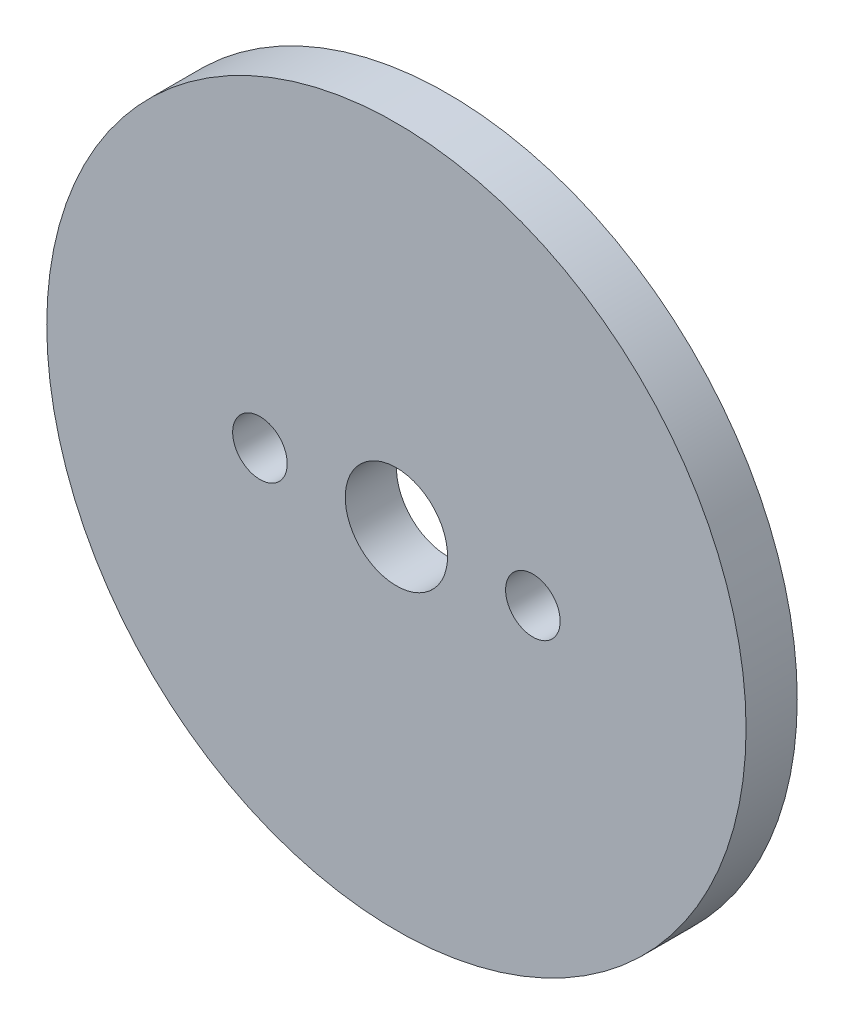
ISO-10303-21;
HEADER;
FILE_DESCRIPTION(('STEP AP214'),'2;1');
FILE_NAME('part.step','',(''),(''),'','','');
FILE_SCHEMA(('AUTOMOTIVE_DESIGN { 1 0 10303 214 1 1 1 1 }'));
ENDSEC;
DATA;
#1=APPLICATION_CONTEXT('core data for automotive mechanical design processes');
#2=APPLICATION_PROTOCOL_DEFINITION('international standard','automotive_design',2000,#1);
#3=PRODUCT_CONTEXT('',#1,'mechanical');
#4=PRODUCT('Part','Part','',(#3));
#5=PRODUCT_RELATED_PRODUCT_CATEGORY('part','',(#4));
#6=PRODUCT_DEFINITION_FORMATION('','',#4);
#7=PRODUCT_DEFINITION_CONTEXT('part definition',#1,'design');
#8=PRODUCT_DEFINITION('design','',#6,#7);
#9=PRODUCT_DEFINITION_SHAPE('','',#8);
#10=(LENGTH_UNIT() NAMED_UNIT(*) SI_UNIT(.MILLI.,.METRE.));
#11=(NAMED_UNIT(*) PLANE_ANGLE_UNIT() SI_UNIT($,.RADIAN.));
#12=(NAMED_UNIT(*) SI_UNIT($,.STERADIAN.) SOLID_ANGLE_UNIT());
#13=UNCERTAINTY_MEASURE_WITH_UNIT(LENGTH_MEASURE(1.E-05),#10,'distance_accuracy_value','');
#14=(GEOMETRIC_REPRESENTATION_CONTEXT(3) GLOBAL_UNCERTAINTY_ASSIGNED_CONTEXT((#13)) GLOBAL_UNIT_ASSIGNED_CONTEXT((#10,
#11,#12)) REPRESENTATION_CONTEXT('',''));
#15=CARTESIAN_POINT('',(0.,0.,0.));
#16=DIRECTION('',(0.,0.,1.));
#17=DIRECTION('',(1.,0.,0.));
#18=AXIS2_PLACEMENT_3D('',#15,#16,#17);
#19=CARTESIAN_POINT('',(0.,0.,1.5));
#20=DIRECTION('',(0.,0.,1.));
#21=DIRECTION('',(1.,0.,0.));
#22=AXIS2_PLACEMENT_3D('',#19,#20,#21);
#23=PLANE('',#22);
#24=CARTESIAN_POINT('',(-8.,0.,1.5));
#25=DIRECTION('',(0.,0.,1.));
#26=DIRECTION('',(1.,0.,0.));
#27=AXIS2_PLACEMENT_3D('',#24,#25,#26);
#28=CIRCLE('',#27,1.6);
#29=CARTESIAN_POINT('',(-6.4,0.,1.5));
#30=VERTEX_POINT('',#29);
#31=EDGE_CURVE('E61',#30,#30,#28,.T.);
#32=ORIENTED_EDGE('',*,*,#31,.F.);
#33=EDGE_LOOP('',(#32));
#34=FACE_BOUND('',#33,.T.);
#35=CARTESIAN_POINT('',(0.,0.,1.5));
#36=DIRECTION('',(0.,0.,1.));
#37=DIRECTION('',(1.,0.,0.));
#38=AXIS2_PLACEMENT_3D('',#35,#36,#37);
#39=CIRCLE('',#38,20.5);
#40=CARTESIAN_POINT('',(20.5,0.,1.5));
#41=VERTEX_POINT('',#40);
#42=EDGE_CURVE('E11',#41,#41,#39,.T.);
#43=ORIENTED_EDGE('',*,*,#42,.T.);
#44=EDGE_LOOP('',(#43));
#45=FACE_BOUND('',#44,.T.);
#46=CARTESIAN_POINT('',(0.,0.,1.5));
#47=DIRECTION('',(0.,0.,1.));
#48=DIRECTION('',(1.,0.,0.));
#49=AXIS2_PLACEMENT_3D('',#46,#47,#48);
#50=CIRCLE('',#49,3.);
#51=CARTESIAN_POINT('',(3.,0.,1.5));
#52=VERTEX_POINT('',#51);
#53=EDGE_CURVE('E48',#52,#52,#50,.T.);
#54=ORIENTED_EDGE('',*,*,#53,.F.);
#55=EDGE_LOOP('',(#54));
#56=FACE_BOUND('',#55,.T.);
#57=CARTESIAN_POINT('',(8.,0.,1.5));
#58=DIRECTION('',(0.,0.,1.));
#59=DIRECTION('',(1.,0.,0.));
#60=AXIS2_PLACEMENT_3D('',#57,#58,#59);
#61=CIRCLE('',#60,1.6);
#62=CARTESIAN_POINT('',(9.6,0.,1.5));
#63=VERTEX_POINT('',#62);
#64=EDGE_CURVE('E62',#63,#63,#61,.T.);
#65=ORIENTED_EDGE('',*,*,#64,.F.);
#66=EDGE_LOOP('',(#65));
#67=FACE_BOUND('',#66,.T.);
#68=ADVANCED_FACE('F34',(#34,#45,#56,#67),#23,.T.);
#69=CARTESIAN_POINT('',(0.,0.,-1.5));
#70=DIRECTION('',(0.,0.,1.));
#71=DIRECTION('',(1.,0.,0.));
#72=AXIS2_PLACEMENT_3D('',#69,#70,#71);
#73=PLANE('',#72);
#74=CARTESIAN_POINT('',(0.,0.,-1.5));
#75=DIRECTION('',(0.,0.,1.));
#76=DIRECTION('',(1.,0.,0.));
#77=AXIS2_PLACEMENT_3D('',#74,#75,#76);
#78=CIRCLE('',#77,20.5);
#79=CARTESIAN_POINT('',(20.5,0.,-1.5));
#80=VERTEX_POINT('',#79);
#81=EDGE_CURVE('E38',#80,#80,#78,.T.);
#82=ORIENTED_EDGE('',*,*,#81,.F.);
#83=EDGE_LOOP('',(#82));
#84=FACE_BOUND('',#83,.T.);
#85=CARTESIAN_POINT('',(0.,0.,-1.5));
#86=DIRECTION('',(0.,0.,1.));
#87=DIRECTION('',(1.,0.,0.));
#88=AXIS2_PLACEMENT_3D('',#85,#86,#87);
#89=CIRCLE('',#88,3.);
#90=CARTESIAN_POINT('',(3.,0.,-1.5));
#91=VERTEX_POINT('',#90);
#92=EDGE_CURVE('E51',#91,#91,#89,.T.);
#93=ORIENTED_EDGE('',*,*,#92,.T.);
#94=EDGE_LOOP('',(#93));
#95=FACE_BOUND('',#94,.T.);
#96=CARTESIAN_POINT('',(-8.,0.,-1.5));
#97=DIRECTION('',(0.,0.,1.));
#98=DIRECTION('',(1.,0.,0.));
#99=AXIS2_PLACEMENT_3D('',#96,#97,#98);
#100=CIRCLE('',#99,1.6);
#101=CARTESIAN_POINT('',(-6.4,0.,-1.5));
#102=VERTEX_POINT('',#101);
#103=EDGE_CURVE('E59',#102,#102,#100,.T.);
#104=ORIENTED_EDGE('',*,*,#103,.T.);
#105=EDGE_LOOP('',(#104));
#106=FACE_BOUND('',#105,.T.);
#107=CARTESIAN_POINT('',(8.,0.,-1.5));
#108=DIRECTION('',(0.,0.,1.));
#109=DIRECTION('',(1.,0.,0.));
#110=AXIS2_PLACEMENT_3D('',#107,#108,#109);
#111=CIRCLE('',#110,1.6);
#112=CARTESIAN_POINT('',(9.6,0.,-1.5));
#113=VERTEX_POINT('',#112);
#114=EDGE_CURVE('E66',#113,#113,#111,.T.);
#115=ORIENTED_EDGE('',*,*,#114,.T.);
#116=EDGE_LOOP('',(#115));
#117=FACE_BOUND('',#116,.T.);
#118=ADVANCED_FACE('F77',(#84,#95,#106,#117),#73,.F.);
#119=CARTESIAN_POINT('',(0.,0.,1.5));
#120=DIRECTION('',(0.,0.,-1.));
#121=DIRECTION('',(-1.,0.,0.));
#122=AXIS2_PLACEMENT_3D('',#119,#120,#121);
#123=CYLINDRICAL_SURFACE('',#122,20.5);
#124=ORIENTED_EDGE('',*,*,#42,.F.);
#125=EDGE_LOOP('',(#124));
#126=FACE_BOUND('',#125,.T.);
#127=ORIENTED_EDGE('',*,*,#81,.T.);
#128=EDGE_LOOP('',(#127));
#129=FACE_BOUND('',#128,.T.);
#130=ADVANCED_FACE('F36',(#126,#129),#123,.T.);
#131=CARTESIAN_POINT('',(0.,0.,1.5));
#132=DIRECTION('',(0.,0.,-1.));
#133=DIRECTION('',(-1.,0.,0.));
#134=AXIS2_PLACEMENT_3D('',#131,#132,#133);
#135=CYLINDRICAL_SURFACE('',#134,3.);
#136=ORIENTED_EDGE('',*,*,#53,.T.);
#137=EDGE_LOOP('',(#136));
#138=FACE_BOUND('',#137,.T.);
#139=ORIENTED_EDGE('',*,*,#92,.F.);
#140=EDGE_LOOP('',(#139));
#141=FACE_BOUND('',#140,.T.);
#142=ADVANCED_FACE('F86',(#138,#141),#135,.F.);
#143=CARTESIAN_POINT('',(-8.,0.,1.5));
#144=DIRECTION('',(0.,0.,-1.));
#145=DIRECTION('',(-1.,0.,0.));
#146=AXIS2_PLACEMENT_3D('',#143,#144,#145);
#147=CYLINDRICAL_SURFACE('',#146,1.6);
#148=ORIENTED_EDGE('',*,*,#31,.T.);
#149=EDGE_LOOP('',(#148));
#150=FACE_BOUND('',#149,.T.);
#151=ORIENTED_EDGE('',*,*,#103,.F.);
#152=EDGE_LOOP('',(#151));
#153=FACE_BOUND('',#152,.T.);
#154=ADVANCED_FACE('F89',(#150,#153),#147,.F.);
#155=CARTESIAN_POINT('',(8.,0.,1.5));
#156=DIRECTION('',(0.,0.,-1.));
#157=DIRECTION('',(-1.,0.,0.));
#158=AXIS2_PLACEMENT_3D('',#155,#156,#157);
#159=CYLINDRICAL_SURFACE('',#158,1.6);
#160=ORIENTED_EDGE('',*,*,#64,.T.);
#161=EDGE_LOOP('',(#160));
#162=FACE_BOUND('',#161,.T.);
#163=ORIENTED_EDGE('',*,*,#114,.F.);
#164=EDGE_LOOP('',(#163));
#165=FACE_BOUND('',#164,.T.);
#166=ADVANCED_FACE('F73',(#162,#165),#159,.F.);
#167=CLOSED_SHELL('',(#68,#118,#130,#142,#154,#166));
#168=MANIFOLD_SOLID_BREP('B2',#167);
#169=ADVANCED_BREP_SHAPE_REPRESENTATION('',(#18,#168),#14);
#170=SHAPE_DEFINITION_REPRESENTATION(#9,#169);
ENDSEC;
END-ISO-10303-21;
